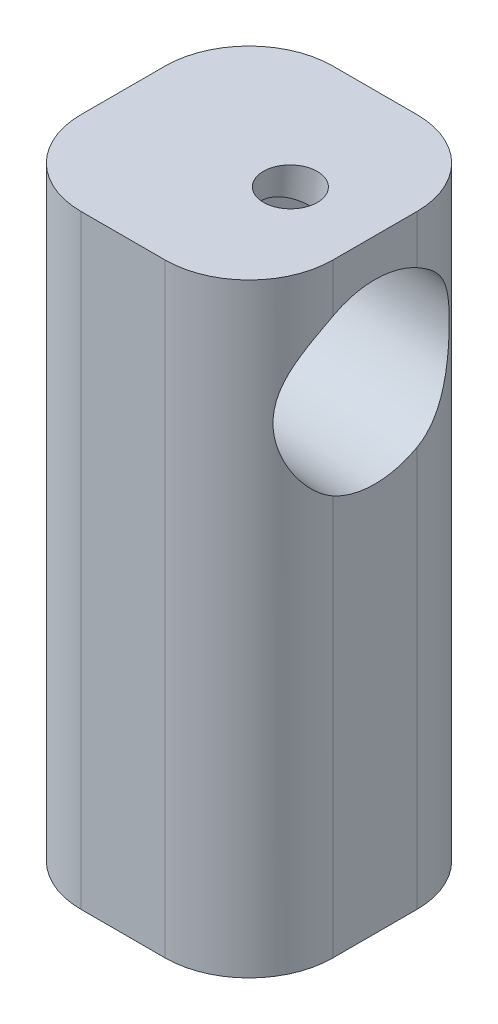
ISO-10303-21;
HEADER;
FILE_DESCRIPTION(('STEP AP214'),'2;1');
FILE_NAME('part.step','',(''),(''),'','','');
FILE_SCHEMA(('AUTOMOTIVE_DESIGN { 1 0 10303 214 1 1 1 1 }'));
ENDSEC;
DATA;
#1=APPLICATION_CONTEXT('core data for automotive mechanical design processes');
#2=APPLICATION_PROTOCOL_DEFINITION('international standard','automotive_design',2000,#1);
#3=PRODUCT_CONTEXT('',#1,'mechanical');
#4=PRODUCT('Part','Part','',(#3));
#5=PRODUCT_RELATED_PRODUCT_CATEGORY('part','',(#4));
#6=PRODUCT_DEFINITION_FORMATION('','',#4);
#7=PRODUCT_DEFINITION_CONTEXT('part definition',#1,'design');
#8=PRODUCT_DEFINITION('design','',#6,#7);
#9=PRODUCT_DEFINITION_SHAPE('','',#8);
#10=(LENGTH_UNIT() NAMED_UNIT(*) SI_UNIT(.MILLI.,.METRE.));
#11=(NAMED_UNIT(*) PLANE_ANGLE_UNIT() SI_UNIT($,.RADIAN.));
#12=(NAMED_UNIT(*) SI_UNIT($,.STERADIAN.) SOLID_ANGLE_UNIT());
#13=UNCERTAINTY_MEASURE_WITH_UNIT(LENGTH_MEASURE(1.E-05),#10,'distance_accuracy_value','');
#14=(GEOMETRIC_REPRESENTATION_CONTEXT(3) GLOBAL_UNCERTAINTY_ASSIGNED_CONTEXT((#13)) GLOBAL_UNIT_ASSIGNED_CONTEXT((#10,
#11,#12)) REPRESENTATION_CONTEXT('',''));
#15=CARTESIAN_POINT('',(0.,0.,0.));
#16=DIRECTION('',(0.,0.,1.));
#17=DIRECTION('',(1.,0.,0.));
#18=AXIS2_PLACEMENT_3D('',#15,#16,#17);
#19=CARTESIAN_POINT('',(10.2157187728761,28.2038178143041,0.));
#20=DIRECTION('',(-0.995396198367179,0.0958457525202242,0.));
#21=DIRECTION('',(-0.0958457525202242,-0.995396198367179,0.));
#22=AXIS2_PLACEMENT_3D('',#19,#20,#21);
#23=CYLINDRICAL_SURFACE('',#22,5.25);
#24=CARTESIAN_POINT('',(-0.18661653247194,29.2054487798877,0.));
#25=DIRECTION('',(0.995396198367179,-0.0958457525202242,0.));
#26=DIRECTION('',(0.0958457525202242,0.995396198367179,0.));
#27=AXIS2_PLACEMENT_3D('',#24,#25,#26);
#28=CIRCLE('',#27,5.25);
#29=CARTESIAN_POINT('',(0.316573668259237,34.4312788213154,0.));
#30=VERTEX_POINT('',#29);
#31=EDGE_CURVE('E163',#30,#30,#28,.T.);
#32=ORIENTED_EDGE('',*,*,#31,.F.);
#33=EDGE_LOOP('',(#32));
#34=FACE_BOUND('',#33,.T.);
#35=CARTESIAN_POINT('',(7.5,28.4653117901165,0.));
#36=DIRECTION('',(-1.,0.,0.));
#37=DIRECTION('',(0.,1.,0.));
#38=AXIS2_PLACEMENT_3D('',#35,#36,#37);
#39=ELLIPSE('',#38,5.27428174691842,5.25);
#40=CARTESIAN_POINT('',(7.5,33.1032100820004,-2.5));
#41=VERTEX_POINT('',#40);
#42=CARTESIAN_POINT('',(7.5,33.1032100820004,2.5));
#43=VERTEX_POINT('',#42);
#44=EDGE_CURVE('E59',#41,#43,#39,.F.);
#45=ORIENTED_EDGE('',*,*,#44,.T.);
#46=CARTESIAN_POINT('',(7.5,23.8274134982327,2.5));
#47=CARTESIAN_POINT('',(7.5000115752968,23.8927678623588,2.62018650620459));
#48=CARTESIAN_POINT('',(7.49566827138946,23.9631423750051,2.73751600941263));
#49=CARTESIAN_POINT('',(7.47958977796429,24.112872854166,2.96549680146251));
#50=CARTESIAN_POINT('',(7.4678671041971,24.192213427261,3.07615905076094));
#51=CARTESIAN_POINT('',(7.43846862667576,24.3583119322207,3.28931267671159));
#52=CARTESIAN_POINT('',(7.42084601580531,24.4449985937958,3.39186728379978));
#53=CARTESIAN_POINT('',(7.38090327302345,24.6255528901397,3.58947339538549));
#54=CARTESIAN_POINT('',(7.35858112569253,24.7194235947921,3.68452165662306));
#55=CARTESIAN_POINT('',(7.28674047875172,25.0094395011213,3.95676481057582));
#56=CARTESIAN_POINT('',(7.23210021472681,25.2152043723929,4.12259871434237));
#57=CARTESIAN_POINT('',(7.14687971141707,25.5396504698289,4.34742506234745));
#58=CARTESIAN_POINT('',(7.11786644757508,25.6506771327631,4.41850118574999));
#59=CARTESIAN_POINT('',(7.05989163151479,25.8775705571239,4.55248819234434));
#60=CARTESIAN_POINT('',(7.03093008636022,25.9934379337644,4.61539803347207));
#61=CARTESIAN_POINT('',(6.93642200544951,26.3870504669977,4.81113532003393));
#62=CARTESIAN_POINT('',(6.87346732276981,26.6750635949737,4.92562424622554));
#63=CARTESIAN_POINT('',(6.79499414489277,27.1203276496223,5.06040993345684));
#64=CARTESIAN_POINT('',(6.77150439258019,27.2708737447383,5.0991698563426));
#65=CARTESIAN_POINT('',(6.7314436436814,27.5756567335923,5.16389718587623));
#66=CARTESIAN_POINT('',(6.7148714632035,27.7298929910048,5.18986678163177));
#67=CARTESIAN_POINT('',(6.69070777181306,28.0322434271527,5.22735014284705));
#68=CARTESIAN_POINT('',(6.68267701848308,28.1802345966139,5.23957302600452));
#69=CARTESIAN_POINT('',(6.67475329582567,28.4769501681375,5.25163436051313));
#70=CARTESIAN_POINT('',(6.6748598736388,28.6256745289358,5.25147350104537));
#71=CARTESIAN_POINT('',(6.68333451800781,28.9222840375265,5.23857080777005));
#72=CARTESIAN_POINT('',(6.69169959080258,29.0701694698981,5.22583353299917));
#73=CARTESIAN_POINT('',(6.7161649176327,29.363660473326,5.18783568863149));
#74=CARTESIAN_POINT('',(6.73226478189367,29.5092661588824,5.16257575007919));
#75=CARTESIAN_POINT('',(6.76810231343031,29.7746400275823,5.10466221270636));
#76=CARTESIAN_POINT('',(6.78689307043667,29.8949232105523,5.0737548870642));
#77=CARTESIAN_POINT('',(6.82833625583039,30.1323098007199,5.00343170194063));
#78=CARTESIAN_POINT('',(6.85098991640635,30.2494121794446,4.96401312647004));
#79=CARTESIAN_POINT('',(6.92328834531948,30.5952764858473,4.83333279726245));
#80=CARTESIAN_POINT('',(6.97726478263407,30.8185569278981,4.7296549571062));
#81=CARTESIAN_POINT('',(7.09439487890042,31.2713857643292,4.47810070900819));
#82=CARTESIAN_POINT('',(7.15789583975968,31.4987840859266,4.32655030827397));
#83=CARTESIAN_POINT('',(7.27671319006236,31.9279147196296,3.98828797495868));
#84=CARTESIAN_POINT('',(7.33204286085387,32.1296886043685,3.80163424653369));
#85=CARTESIAN_POINT('',(7.39614240626913,32.3925570002548,3.51730394838744));
#86=CARTESIAN_POINT('',(7.41304904310161,32.4660351057519,3.43261548720782));
#87=CARTESIAN_POINT('',(7.44293748374284,32.6078731408655,3.25839887973002));
#88=CARTESIAN_POINT('',(7.45592036714128,32.6762344744196,3.16887207267059));
#89=CARTESIAN_POINT('',(7.47727622241994,32.8077472814441,2.98508007849629));
#90=CARTESIAN_POINT('',(7.48563366250557,32.870880603606,2.89080007285826));
#91=CARTESIAN_POINT('',(7.49700250933391,32.9914281935094,2.69824586021539));
#92=CARTESIAN_POINT('',(7.50000978302263,33.0488380074992,2.59996862520474));
#93=CARTESIAN_POINT('',(7.5,33.1032100820004,2.5));
#94=B_SPLINE_CURVE_WITH_KNOTS('',3,(#46,#47,#48,#49,#50,#51,#52,#53,#54,#55,#56,#57,#58,#59,#60,
#61,#62,#63,#64,#65,#66,#67,#68,#69,#70,#71,#72,#73,#74,#75,#76,#77,#78,#79,#80,#81,#82,#83,#84,
#85,#86,#87,#88,#89,#90,#91,#92,#93),.UNSPECIFIED.,.F.,.F.,(4,2,2,2,2,2,2,2,2,2,2,2,2,2,2,2,2,2,
2,2,2,2,2,4),(0.,0.410066313355361,0.819439002355257,1.2252160219284,1.63116741676319,
2.43720185029728,2.84188785644462,3.24662545217151,4.18986221732903,4.66098531622723,
5.13202775277063,5.57746273640006,6.02287293066184,6.46812171993643,6.91334807442819,
7.28975791264398,7.66628804340756,8.41946704241959,9.25787929507611,10.0949134566852,
10.4348603953986,10.7747137150718,11.1157014109618,11.4569524088677),.UNSPECIFIED.);
#95=CARTESIAN_POINT('',(7.5,23.8274134982327,2.5));
#96=VERTEX_POINT('',#95);
#97=EDGE_CURVE('E124',#96,#43,#94,.T.);
#98=ORIENTED_EDGE('',*,*,#97,.F.);
#99=CARTESIAN_POINT('',(7.5,28.4653117901165,0.));
#100=DIRECTION('',(-1.,0.,0.));
#101=DIRECTION('',(0.,1.,0.));
#102=AXIS2_PLACEMENT_3D('',#99,#100,#101);
#103=ELLIPSE('',#102,5.27428174691842,5.25);
#104=CARTESIAN_POINT('',(7.5,23.8274134982327,-2.5));
#105=VERTEX_POINT('',#104);
#106=EDGE_CURVE('E127',#96,#105,#103,.F.);
#107=ORIENTED_EDGE('',*,*,#106,.T.);
#108=CARTESIAN_POINT('',(7.5,33.1032100820004,-2.5));
#109=CARTESIAN_POINT('',(7.50001998674062,33.0369019499913,-2.62193681639777));
#110=CARTESIAN_POINT('',(7.49554108527629,32.9660735277141,-2.7413295682139));
#111=CARTESIAN_POINT('',(7.4788440174948,32.8160154440221,-2.97396196931254));
#112=CARTESIAN_POINT('',(7.46663478838785,32.7367955721086,-3.08720856037974));
#113=CARTESIAN_POINT('',(7.43582015690662,32.5709244239072,-3.30612782935598));
#114=CARTESIAN_POINT('',(7.41725255069452,32.4843192822286,-3.41184090153194));
#115=CARTESIAN_POINT('',(7.3750309193707,32.3038464226561,-3.61576469458365));
#116=CARTESIAN_POINT('',(7.35137548377914,32.2099766954574,-3.71397332477822));
#117=CARTESIAN_POINT('',(7.27496401687642,31.9189550510605,-3.99579784659961));
#118=CARTESIAN_POINT('',(7.21659127928187,31.7115936174592,-4.16766230108876));
#119=CARTESIAN_POINT('',(7.12600744810291,31.3830528181752,-4.39920939781707));
#120=CARTESIAN_POINT('',(7.09526121280936,31.2704440379201,-4.47210471169599));
#121=CARTESIAN_POINT('',(7.03413875176891,31.0396850878396,-4.60883345072613));
#122=CARTESIAN_POINT('',(7.00376256482431,30.9215343430924,-4.67266593292348));
#123=CARTESIAN_POINT('',(6.94208303892426,30.6690186338683,-4.79632556400705));
#124=CARTESIAN_POINT('',(6.91095269150025,30.5341633994023,-4.8552399415599));
#125=CARTESIAN_POINT('',(6.85267139092977,30.2591204645297,-4.96128296906913));
#126=CARTESIAN_POINT('',(6.82551858285744,30.1189352884075,-5.00841712002388));
#127=CARTESIAN_POINT('',(6.77693696656577,29.8343124495308,-5.09038259213347));
#128=CARTESIAN_POINT('',(6.75549779459445,29.6898830211501,-5.12523622597816));
#129=CARTESIAN_POINT('',(6.71972833053916,29.3976959304438,-5.18235665097596));
#130=CARTESIAN_POINT('',(6.70539672635829,29.2499388876835,-5.20462576540791));
#131=CARTESIAN_POINT('',(6.68582510135536,28.9670839900684,-5.23480440310699));
#132=CARTESIAN_POINT('',(6.67983182798382,28.8321643809841,-5.24390716345121));
#133=CARTESIAN_POINT('',(6.6747041398593,28.5619014314784,-5.25170279103364));
#134=CARTESIAN_POINT('',(6.67556936328051,28.4265581137868,-5.2503962074256));
#135=CARTESIAN_POINT('',(6.684009206645,28.1565132563051,-5.23754021107649));
#136=CARTESIAN_POINT('',(6.69158686873349,28.021812035352,-5.22598615407373));
#137=CARTESIAN_POINT('',(6.71288761917239,27.7541583479324,-5.19294442185493));
#138=CARTESIAN_POINT('',(6.72661089985077,27.621205936329,-5.17145643575457));
#139=CARTESIAN_POINT('',(6.77371793498652,27.2426453014374,-5.0959160745952));
#140=CARTESIAN_POINT('',(6.81380011009303,27.0001889226442,-5.02981883141516));
#141=CARTESIAN_POINT('',(6.9055590391362,26.5282102421331,-4.86638130914973));
#142=CARTESIAN_POINT('',(6.95725139687039,26.2987058718862,-4.76899890707187));
#143=CARTESIAN_POINT('',(7.04272489003272,25.9454801921234,-4.59024061850044));
#144=CARTESIAN_POINT('',(7.07527789706862,25.8165723480858,-4.51836399100458));
#145=CARTESIAN_POINT('',(7.14014529416681,25.5649320356772,-4.36441535069588));
#146=CARTESIAN_POINT('',(7.17245961114434,25.4422013968611,-4.28234034201994));
#147=CARTESIAN_POINT('',(7.26647746270493,25.0848068555535,-4.0214263431919));
#148=CARTESIAN_POINT('',(7.32550896478912,24.8599814306624,-3.82741551698741));
#149=CARTESIAN_POINT('',(7.39293306082581,24.5723044160512,-3.53262419097886));
#150=CARTESIAN_POINT('',(7.41016404383055,24.4947553149705,-3.44773666763902));
#151=CARTESIAN_POINT('',(7.44075545229649,24.3452111860705,-3.2725496714031));
#152=CARTESIAN_POINT('',(7.45411750783841,24.2732138285642,-3.18225249714544));
#153=CARTESIAN_POINT('',(7.47622022909484,24.1349391406551,-2.99604823729854));
#154=CARTESIAN_POINT('',(7.48493516514018,24.0686953224586,-2.90011311796905));
#155=CARTESIAN_POINT('',(7.49683207207068,23.9428754701684,-2.7034785419648));
#156=CARTESIAN_POINT('',(7.50000712729515,23.8833078568882,-2.60277329130369));
#157=CARTESIAN_POINT('',(7.5,23.8274134982327,-2.5));
#158=B_SPLINE_CURVE_WITH_KNOTS('',3,(#108,#109,#110,#111,#112,#113,#114,#115,#116,#117,#118,
#119,#120,#121,#122,#123,#124,#125,#126,#127,#128,#129,#130,#131,#132,#133,#134,#135,#136,#137,
#138,#139,#140,#141,#142,#143,#144,#145,#146,#147,#148,#149,#150,#151,#152,#153,#154,#155,#156,
#157),.UNSPECIFIED.,.F.,.F.,(4,2,2,2,2,2,2,2,2,2,2,2,2,2,2,2,2,2,2,2,2,2,2,2,4),(0.,
0.416119348822604,0.831758488724067,1.24496863654772,1.65829348506126,2.48100069035423,
2.89357086079916,3.3061839262248,3.75686213965554,4.20732950554665,4.65697413677774,
5.10653573016003,5.51204614722256,5.9175351713815,6.3232080613502,6.72889364779374,
7.48933084424157,8.25079623078237,8.70376219465684,9.15686153719988,10.0597846390729,
10.4083435205131,10.756755330535,11.1070766700245,11.4578350179764),.UNSPECIFIED.);
#159=EDGE_CURVE('E183',#41,#105,#158,.T.);
#160=ORIENTED_EDGE('',*,*,#159,.F.);
#161=EDGE_LOOP('',(#45,#98,#107,#160));
#162=FACE_BOUND('',#161,.T.);
#163=CARTESIAN_POINT('',(0.699776919924022,34.3943805449464,0.));
#164=CARTESIAN_POINT('',(0.699777738487861,34.3943798222301,-0.0877095829599574));
#165=CARTESIAN_POINT('',(0.706766951507206,34.3914783148794,-0.175428139234278));
#166=CARTESIAN_POINT('',(0.734485554989229,34.3801372466754,-0.348306725127632));
#167=CARTESIAN_POINT('',(0.755218669631588,34.3716961847772,-0.433466054734184));
#168=CARTESIAN_POINT('',(0.809710438519464,34.3500501798546,-0.598707911694997));
#169=CARTESIAN_POINT('',(0.843449518096817,34.3368523978786,-0.678797858853131));
#170=CARTESIAN_POINT('',(0.922983453965627,34.3068178386677,-0.831997653720761));
#171=CARTESIAN_POINT('',(0.968780027318224,34.289980543205,-0.905106505257146));
#172=CARTESIAN_POINT('',(1.07264381016868,34.2535589992063,-1.04442803485955));
#173=CARTESIAN_POINT('',(1.13100505212719,34.2339135880824,-1.11040550483363));
#174=CARTESIAN_POINT('',(1.25783971278431,34.1938582584343,-1.23153882879992));
#175=CARTESIAN_POINT('',(1.32631489623257,34.1734482069554,-1.28669279031359));
#176=CARTESIAN_POINT('',(1.47351043498286,34.1330657549761,-1.38586534654311));
#177=CARTESIAN_POINT('',(1.55243244654785,34.1131146554458,-1.4295943148774));
#178=CARTESIAN_POINT('',(1.71720899916109,34.0758597408964,-1.50280224576308));
#179=CARTESIAN_POINT('',(1.80306180882419,34.0585552678299,-1.53228475445071));
#180=CARTESIAN_POINT('',(1.97673481072115,34.0284378045448,-1.57531000140866));
#181=CARTESIAN_POINT('',(2.06442711584237,34.0155098041795,-1.58928738558295));
#182=CARTESIAN_POINT('',(2.24145748840112,33.9943054756329,-1.60226310554936));
#183=CARTESIAN_POINT('',(2.33079513700529,33.9860279800851,-1.60126520217188));
#184=CARTESIAN_POINT('',(2.50502593001073,33.9745617224082,-1.58465952487205));
#185=CARTESIAN_POINT('',(2.58996037980374,33.9711943055541,-1.5695992744651));
#186=CARTESIAN_POINT('',(2.75641913579608,33.9686235117149,-1.52618219944499));
#187=CARTESIAN_POINT('',(2.83794309480675,33.9694205576381,-1.49782402467079));
#188=CARTESIAN_POINT('',(2.99653022205708,33.9744428775065,-1.428219088008));
#189=CARTESIAN_POINT('',(3.07351464935774,33.9787161474971,-1.38679688637858));
#190=CARTESIAN_POINT('',(3.21982755765982,33.9896627702984,-1.29236161942605));
#191=CARTESIAN_POINT('',(3.2891541260673,33.9963367209292,-1.23934566830525));
#192=CARTESIAN_POINT('',(3.42123075317983,34.0111821698027,-1.12052082833061));
#193=CARTESIAN_POINT('',(3.48356767963335,34.0194058810312,-1.05425845581457));
#194=CARTESIAN_POINT('',(3.59629400381892,34.0357553123357,-0.912224424592942));
#195=CARTESIAN_POINT('',(3.64668260076278,34.0438810258093,-0.836452129043607));
#196=CARTESIAN_POINT('',(3.73425197461701,34.0588186544157,-0.676775481442183));
#197=CARTESIAN_POINT('',(3.77133642508143,34.065620830851,-0.592817205979653));
#198=CARTESIAN_POINT('',(3.83044263990114,34.0767841347102,-0.419605475352042));
#199=CARTESIAN_POINT('',(3.85246874542182,34.0811459655947,-0.330353554360794));
#200=CARTESIAN_POINT('',(3.88006807403434,34.0866534735221,-0.152624537102264));
#201=CARTESIAN_POINT('',(3.88621864117471,34.0879119311854,-0.0642404637994652));
#202=CARTESIAN_POINT('',(3.8835013967688,34.0873615191741,0.112279032093748));
#203=CARTESIAN_POINT('',(3.87463566078544,34.0855530734089,0.200414487361721));
#204=CARTESIAN_POINT('',(3.84262197881723,34.0792074716815,0.371789057943173));
#205=CARTESIAN_POINT('',(3.8198135809279,34.0747352515402,0.455094513780931));
#206=CARTESIAN_POINT('',(3.76101732925929,34.0637308084984,0.616765676375094));
#207=CARTESIAN_POINT('',(3.72502787369243,34.0571983352454,0.69513078141333));
#208=CARTESIAN_POINT('',(3.64000699764058,34.0427991118464,0.846753612472818));
#209=CARTESIAN_POINT('',(3.59068765153273,34.0349044948183,0.919847018400831));
#210=CARTESIAN_POINT('',(3.48085280688173,34.0190526981915,1.05707622394061));
#211=CARTESIAN_POINT('',(3.42033441446204,34.0110955029324,1.12120970073781));
#212=CARTESIAN_POINT('',(3.2872299126005,33.9961061167814,1.24119656582309));
#213=CARTESIAN_POINT('',(3.2142759166767,33.9891198946086,1.2966484782013));
#214=CARTESIAN_POINT('',(3.06000108678877,33.9778491389036,1.39472275439474));
#215=CARTESIAN_POINT('',(2.97868044212874,33.9735645442601,1.43734540839961));
#216=CARTESIAN_POINT('',(2.81031535012749,33.9689520563009,1.50826881292794));
#217=CARTESIAN_POINT('',(2.72329794206605,33.9686066660348,1.53663236106683));
#218=CARTESIAN_POINT('',(2.54584248022742,33.9726963508528,1.57828583341556));
#219=CARTESIAN_POINT('',(2.4554056586878,33.9771297193868,1.59158113519386));
#220=CARTESIAN_POINT('',(2.27788968178148,33.9907681029935,1.60234725811094));
#221=CARTESIAN_POINT('',(2.19083340571643,33.999759691868,1.60047408593909));
#222=CARTESIAN_POINT('',(2.01876926695903,34.0220621308031,1.58252900575096));
#223=CARTESIAN_POINT('',(1.93376131742526,34.0353727974037,1.56645770077447));
#224=CARTESIAN_POINT('',(1.7692570532391,34.0652584860708,1.52100203229453));
#225=CARTESIAN_POINT('',(1.68970269236094,34.0817879837213,1.49179664087031));
#226=CARTESIAN_POINT('',(1.53681406249054,34.1170329740376,1.42104171061348));
#227=CARTESIAN_POINT('',(1.46348101656303,34.1357488948268,1.37948975173249));
#228=CARTESIAN_POINT('',(1.32205817151328,34.1746923020743,1.2833997696231));
#229=CARTESIAN_POINT('',(1.25426759306008,34.1949501476566,1.22843368462233));
#230=CARTESIAN_POINT('',(1.1286548139446,34.2346938451233,1.10783970308769));
#231=CARTESIAN_POINT('',(1.07083523727172,34.2541794927585,1.04220900883209));
#232=CARTESIAN_POINT('',(0.964941197715081,34.2913412165147,0.899738398219265));
#233=CARTESIAN_POINT('',(0.917217813124676,34.3089439593475,0.822617617894377));
#234=CARTESIAN_POINT('',(0.835170195268976,34.3400399151351,0.660806006214705));
#235=CARTESIAN_POINT('',(0.800840067045315,34.3535349355023,0.576118525514105));
#236=CARTESIAN_POINT('',(0.749332733416378,34.3740835974493,0.41020845240547));
#237=CARTESIAN_POINT('',(0.730797708498414,34.3816412692239,0.329467929591525));
#238=CARTESIAN_POINT('',(0.706020520198721,34.3917896379541,0.165820682652466));
#239=CARTESIAN_POINT('',(0.699776146112462,34.3943812281506,0.0829143508076444));
#240=CARTESIAN_POINT('',(0.699776919924022,34.3943805449464,0.));
#241=B_SPLINE_CURVE_WITH_KNOTS('',3,(#163,#164,#165,#166,#167,#168,#169,#170,#171,#172,#173,
#174,#175,#176,#177,#178,#179,#180,#181,#182,#183,#184,#185,#186,#187,#188,#189,#190,#191,#192,
#193,#194,#195,#196,#197,#198,#199,#200,#201,#202,#203,#204,#205,#206,#207,#208,#209,#210,#211,
#212,#213,#214,#215,#216,#217,#218,#219,#220,#221,#222,#223,#224,#225,#226,#227,#228,#229,#230,
#231,#232,#233,#234,#235,#236,#237,#238,#239,#240),.UNSPECIFIED.,.T.,.F.,(4,2,2,2,2,2,2,2,2,2,2,
2,2,2,2,2,2,2,2,2,2,2,2,2,2,2,2,2,2,2,2,2,2,2,2,2,2,2,4),(0.,0.262824109285108,
0.525719465044115,0.788220684481565,1.05075930594256,1.32028245219729,1.58985268237135,
1.86570841849144,2.14149545497736,2.40933915695281,2.67711559491932,2.93488232680653,
3.19267523585977,3.4540891346815,3.71556817619335,3.98833576632651,4.26112163243436,
4.53584449046141,4.81048811528961,5.07499324760703,5.33946182284088,5.59773301878419,
5.85603561076138,6.12043824156485,6.38490929067034,6.65931385728077,6.93371221656851,
7.20689129051521,7.47997284135405,7.74130933651229,8.00263473241335,8.26050227388833,
8.51842039331228,8.78599781767931,9.05364555117195,9.32945786465114,9.60514864372853,
9.85364841316143,10.1021034811546),.UNSPECIFIED.);
#242=CARTESIAN_POINT('',(0.699776919924022,34.3943805449464,0.));
#243=VERTEX_POINT('',#242);
#244=EDGE_CURVE('E502',#243,#243,#241,.T.);
#245=ORIENTED_EDGE('',*,*,#244,.F.);
#246=EDGE_LOOP('',(#245));
#247=FACE_BOUND('',#246,.T.);
#248=ADVANCED_FACE('F43',(#34,#162,#247),#23,.F.);
#249=CARTESIAN_POINT('',(2.5,20.,-2.5));
#250=DIRECTION('',(0.,-1.,0.));
#251=DIRECTION('',(0.,0.,-1.));
#252=AXIS2_PLACEMENT_3D('',#249,#250,#251);
#253=CYLINDRICAL_SURFACE('',#252,5.);
#254=DIRECTION('',(0.,-1.,0.));
#255=VECTOR('',#254,1.);
#256=CARTESIAN_POINT('',(7.5,20.,-2.5));
#257=LINE('',#256,#255);
#258=CARTESIAN_POINT('',(7.5,36.,-2.5));
#259=VERTEX_POINT('',#258);
#260=EDGE_CURVE('E152',#41,#259,#257,.F.);
#261=ORIENTED_EDGE('',*,*,#260,.F.);
#262=ORIENTED_EDGE('',*,*,#159,.T.);
#263=CARTESIAN_POINT('',(7.5,0.,-2.5));
#264=VERTEX_POINT('',#263);
#265=EDGE_CURVE('E142',#264,#105,#257,.F.);
#266=ORIENTED_EDGE('',*,*,#265,.F.);
#267=CARTESIAN_POINT('',(2.5,0.,-2.5));
#268=DIRECTION('',(0.,1.,0.));
#269=DIRECTION('',(0.,0.,1.));
#270=AXIS2_PLACEMENT_3D('',#267,#268,#269);
#271=CIRCLE('',#270,5.);
#272=CARTESIAN_POINT('',(2.5,0.,-7.5));
#273=VERTEX_POINT('',#272);
#274=EDGE_CURVE('E232',#273,#264,#271,.F.);
#275=ORIENTED_EDGE('',*,*,#274,.F.);
#276=DIRECTION('',(0.,-1.,0.));
#277=VECTOR('',#276,1.);
#278=CARTESIAN_POINT('',(2.5,20.,-7.5));
#279=LINE('',#278,#277);
#280=CARTESIAN_POINT('',(2.5,36.,-7.5));
#281=VERTEX_POINT('',#280);
#282=EDGE_CURVE('E227',#281,#273,#279,.T.);
#283=ORIENTED_EDGE('',*,*,#282,.F.);
#284=CARTESIAN_POINT('',(2.5,36.,-2.5));
#285=DIRECTION('',(0.,-1.,0.));
#286=DIRECTION('',(0.,0.,-1.));
#287=AXIS2_PLACEMENT_3D('',#284,#285,#286);
#288=CIRCLE('',#287,5.);
#289=EDGE_CURVE('E153',#259,#281,#288,.F.);
#290=ORIENTED_EDGE('',*,*,#289,.F.);
#291=EDGE_LOOP('',(#261,#262,#266,#275,#283,#290));
#292=FACE_BOUND('',#291,.T.);
#293=ADVANCED_FACE('F175',(#292),#253,.T.);
#294=CARTESIAN_POINT('',(2.5,20.,2.5));
#295=DIRECTION('',(0.,-1.,0.));
#296=DIRECTION('',(0.,0.,-1.));
#297=AXIS2_PLACEMENT_3D('',#294,#295,#296);
#298=CYLINDRICAL_SURFACE('',#297,5.);
#299=DIRECTION('',(0.,-1.,0.));
#300=VECTOR('',#299,1.);
#301=CARTESIAN_POINT('',(7.5,20.,2.5));
#302=LINE('',#301,#300);
#303=CARTESIAN_POINT('',(7.5,0.,2.5));
#304=VERTEX_POINT('',#303);
#305=EDGE_CURVE('E139',#96,#304,#302,.T.);
#306=ORIENTED_EDGE('',*,*,#305,.F.);
#307=ORIENTED_EDGE('',*,*,#97,.T.);
#308=CARTESIAN_POINT('',(7.5,36.,2.5));
#309=VERTEX_POINT('',#308);
#310=EDGE_CURVE('E149',#309,#43,#302,.T.);
#311=ORIENTED_EDGE('',*,*,#310,.F.);
#312=CARTESIAN_POINT('',(2.5,36.,2.5));
#313=DIRECTION('',(0.,-1.,0.));
#314=DIRECTION('',(0.,0.,-1.));
#315=AXIS2_PLACEMENT_3D('',#312,#313,#314);
#316=CIRCLE('',#315,5.);
#317=CARTESIAN_POINT('',(2.5,36.,7.5));
#318=VERTEX_POINT('',#317);
#319=EDGE_CURVE('E221',#318,#309,#316,.F.);
#320=ORIENTED_EDGE('',*,*,#319,.F.);
#321=DIRECTION('',(0.,-1.,0.));
#322=VECTOR('',#321,1.);
#323=CARTESIAN_POINT('',(2.5,20.,7.5));
#324=LINE('',#323,#322);
#325=CARTESIAN_POINT('',(2.5,0.,7.5));
#326=VERTEX_POINT('',#325);
#327=EDGE_CURVE('E158',#326,#318,#324,.F.);
#328=ORIENTED_EDGE('',*,*,#327,.F.);
#329=CARTESIAN_POINT('',(2.5,0.,2.5));
#330=DIRECTION('',(0.,1.,0.));
#331=DIRECTION('',(0.,0.,1.));
#332=AXIS2_PLACEMENT_3D('',#329,#330,#331);
#333=CIRCLE('',#332,5.);
#334=EDGE_CURVE('E147',#304,#326,#333,.F.);
#335=ORIENTED_EDGE('',*,*,#334,.F.);
#336=EDGE_LOOP('',(#306,#307,#311,#320,#328,#335));
#337=FACE_BOUND('',#336,.T.);
#338=ADVANCED_FACE('F145',(#337),#298,.T.);
#339=CARTESIAN_POINT('',(-8.08104701975917,29.9655959775702,0.));
#340=DIRECTION('',(0.995396198367179,-0.0958457525202242,0.));
#341=DIRECTION('',(0.0958457525202242,0.995396198367179,0.));
#342=AXIS2_PLACEMENT_3D('',#339,#340,#341);
#343=CYLINDRICAL_SURFACE('',#342,2.5);
#344=CARTESIAN_POINT('',(-7.5,29.9096475130796,0.));
#345=DIRECTION('',(1.,0.,0.));
#346=DIRECTION('',(0.,-1.,0.));
#347=AXIS2_PLACEMENT_3D('',#344,#345,#346);
#348=ELLIPSE('',#347,2.51156273662782,2.5);
#349=CARTESIAN_POINT('',(-7.5,29.9096475130796,2.5));
#350=VERTEX_POINT('',#349);
#351=CARTESIAN_POINT('',(-7.5,29.9096475130796,-2.5));
#352=VERTEX_POINT('',#351);
#353=EDGE_CURVE('E191',#350,#352,#348,.T.);
#354=ORIENTED_EDGE('',*,*,#353,.F.);
#355=EDGE_CURVE('E66',#352,#350,#348,.T.);
#356=ORIENTED_EDGE('',*,*,#355,.F.);
#357=EDGE_LOOP('',(#354,#356));
#358=FACE_BOUND('',#357,.T.);
#359=CARTESIAN_POINT('',(-0.18661653247194,29.2054487798877,0.));
#360=DIRECTION('',(0.995396198367179,-0.0958457525202242,0.));
#361=DIRECTION('',(0.0958457525202242,0.995396198367179,0.));
#362=AXIS2_PLACEMENT_3D('',#359,#360,#361);
#363=CIRCLE('',#362,2.5);
#364=CARTESIAN_POINT('',(0.0529978488286202,31.6939392758057,0.));
#365=VERTEX_POINT('',#364);
#366=EDGE_CURVE('E143',#365,#365,#363,.F.);
#367=ORIENTED_EDGE('',*,*,#366,.F.);
#368=EDGE_LOOP('',(#367));
#369=FACE_BOUND('',#368,.T.);
#370=ADVANCED_FACE('F179',(#358,#369),#343,.F.);
#371=CARTESIAN_POINT('',(-7.5,20.,7.5));
#372=DIRECTION('',(1.,0.,0.));
#373=DIRECTION('',(0.,0.,-1.));
#374=AXIS2_PLACEMENT_3D('',#371,#372,#373);
#375=PLANE('',#374);
#376=DIRECTION('',(0.,-1.,0.));
#377=VECTOR('',#376,1.);
#378=CARTESIAN_POINT('',(-7.5,20.,-2.5));
#379=LINE('',#378,#377);
#380=CARTESIAN_POINT('',(-7.5,36.,-2.5));
#381=VERTEX_POINT('',#380);
#382=EDGE_CURVE('E237',#381,#352,#379,.T.);
#383=ORIENTED_EDGE('',*,*,#382,.T.);
#384=ORIENTED_EDGE('',*,*,#355,.T.);
#385=DIRECTION('',(0.,-1.,0.));
#386=VECTOR('',#385,1.);
#387=CARTESIAN_POINT('',(-7.5,20.,2.5));
#388=LINE('',#387,#386);
#389=CARTESIAN_POINT('',(-7.5,36.,2.5));
#390=VERTEX_POINT('',#389);
#391=EDGE_CURVE('E215',#350,#390,#388,.F.);
#392=ORIENTED_EDGE('',*,*,#391,.T.);
#393=DIRECTION('',(0.,0.,1.));
#394=VECTOR('',#393,1.);
#395=CARTESIAN_POINT('',(-7.5,36.,7.5));
#396=LINE('',#395,#394);
#397=EDGE_CURVE('E259',#381,#390,#396,.T.);
#398=ORIENTED_EDGE('',*,*,#397,.F.);
#399=EDGE_LOOP('',(#383,#384,#392,#398));
#400=FACE_BOUND('',#399,.T.);
#401=ADVANCED_FACE('F278',(#400),#375,.F.);
#402=CARTESIAN_POINT('',(7.5,20.,7.5));
#403=DIRECTION('',(-1.,0.,0.));
#404=DIRECTION('',(0.,0.,1.));
#405=AXIS2_PLACEMENT_3D('',#402,#403,#404);
#406=PLANE('',#405);
#407=ORIENTED_EDGE('',*,*,#44,.F.);
#408=ORIENTED_EDGE('',*,*,#260,.T.);
#409=DIRECTION('',(0.,0.,-1.));
#410=VECTOR('',#409,1.);
#411=CARTESIAN_POINT('',(7.5,36.,7.5));
#412=LINE('',#411,#410);
#413=EDGE_CURVE('E263',#309,#259,#412,.T.);
#414=ORIENTED_EDGE('',*,*,#413,.F.);
#415=ORIENTED_EDGE('',*,*,#310,.T.);
#416=EDGE_LOOP('',(#407,#408,#414,#415));
#417=FACE_BOUND('',#416,.T.);
#418=ADVANCED_FACE('F292',(#417),#406,.F.);
#419=CARTESIAN_POINT('',(0.,0.,0.));
#420=DIRECTION('',(0.,1.,0.));
#421=DIRECTION('',(0.,0.,1.));
#422=AXIS2_PLACEMENT_3D('',#419,#420,#421);
#423=PLANE('',#422);
#424=DIRECTION('',(0.,0.,1.));
#425=VECTOR('',#424,1.);
#426=CARTESIAN_POINT('',(-7.5,0.,7.5));
#427=LINE('',#426,#425);
#428=CARTESIAN_POINT('',(-7.5,0.,-2.5));
#429=VERTEX_POINT('',#428);
#430=CARTESIAN_POINT('',(-7.5,0.,2.5));
#431=VERTEX_POINT('',#430);
#432=EDGE_CURVE('E251',#429,#431,#427,.T.);
#433=ORIENTED_EDGE('',*,*,#432,.F.);
#434=CARTESIAN_POINT('',(-2.5,0.,-2.5));
#435=DIRECTION('',(0.,1.,0.));
#436=DIRECTION('',(0.,0.,1.));
#437=AXIS2_PLACEMENT_3D('',#434,#435,#436);
#438=CIRCLE('',#437,5.);
#439=CARTESIAN_POINT('',(-2.5,0.,-7.5));
#440=VERTEX_POINT('',#439);
#441=EDGE_CURVE('E230',#429,#440,#438,.F.);
#442=ORIENTED_EDGE('',*,*,#441,.T.);
#443=DIRECTION('',(-1.,0.,0.));
#444=VECTOR('',#443,1.);
#445=CARTESIAN_POINT('',(7.5,0.,-7.5));
#446=LINE('',#445,#444);
#447=EDGE_CURVE('E243',#273,#440,#446,.T.);
#448=ORIENTED_EDGE('',*,*,#447,.F.);
#449=ORIENTED_EDGE('',*,*,#274,.T.);
#450=DIRECTION('',(0.,0.,-1.));
#451=VECTOR('',#450,1.);
#452=CARTESIAN_POINT('',(7.5,0.,7.5));
#453=LINE('',#452,#451);
#454=EDGE_CURVE('E246',#304,#264,#453,.T.);
#455=ORIENTED_EDGE('',*,*,#454,.F.);
#456=ORIENTED_EDGE('',*,*,#334,.T.);
#457=DIRECTION('',(1.,0.,0.));
#458=VECTOR('',#457,1.);
#459=CARTESIAN_POINT('',(7.5,0.,7.5));
#460=LINE('',#459,#458);
#461=CARTESIAN_POINT('',(-2.5,0.,7.5));
#462=VERTEX_POINT('',#461);
#463=EDGE_CURVE('E248',#462,#326,#460,.T.);
#464=ORIENTED_EDGE('',*,*,#463,.F.);
#465=CARTESIAN_POINT('',(-2.5,0.,2.5));
#466=DIRECTION('',(0.,1.,0.));
#467=DIRECTION('',(0.,0.,1.));
#468=AXIS2_PLACEMENT_3D('',#465,#466,#467);
#469=CIRCLE('',#468,5.);
#470=EDGE_CURVE('E234',#462,#431,#469,.F.);
#471=ORIENTED_EDGE('',*,*,#470,.T.);
#472=EDGE_LOOP('',(#433,#442,#448,#449,#455,#456,#464,#471));
#473=FACE_BOUND('',#472,.T.);
#474=CARTESIAN_POINT('',(0.,0.,0.));
#475=DIRECTION('',(0.,1.,0.));
#476=DIRECTION('',(0.,0.,1.));
#477=AXIS2_PLACEMENT_3D('',#474,#475,#476);
#478=CIRCLE('',#477,4.15);
#479=CARTESIAN_POINT('',(0.,0.,4.15));
#480=VERTEX_POINT('',#479);
#481=EDGE_CURVE('E254',#480,#480,#478,.T.);
#482=ORIENTED_EDGE('',*,*,#481,.T.);
#483=EDGE_LOOP('',(#482));
#484=FACE_BOUND('',#483,.T.);
#485=ADVANCED_FACE('F285',(#473,#484),#423,.F.);
#486=EDGE_CURVE('E241',#431,#350,#388,.F.);
#487=ORIENTED_EDGE('',*,*,#486,.T.);
#488=ORIENTED_EDGE('',*,*,#353,.T.);
#489=EDGE_CURVE('E240',#352,#429,#379,.T.);
#490=ORIENTED_EDGE('',*,*,#489,.T.);
#491=ORIENTED_EDGE('',*,*,#432,.T.);
#492=EDGE_LOOP('',(#487,#488,#490,#491));
#493=FACE_BOUND('',#492,.T.);
#494=ADVANCED_FACE('F271',(#493),#375,.F.);
#495=CARTESIAN_POINT('',(7.5,20.,7.5));
#496=DIRECTION('',(0.,0.,-1.));
#497=DIRECTION('',(-1.,0.,0.));
#498=AXIS2_PLACEMENT_3D('',#495,#496,#497);
#499=PLANE('',#498);
#500=DIRECTION('',(1.,0.,0.));
#501=VECTOR('',#500,1.);
#502=CARTESIAN_POINT('',(-7.5,36.,7.5));
#503=LINE('',#502,#501);
#504=CARTESIAN_POINT('',(-2.5,36.,7.5));
#505=VERTEX_POINT('',#504);
#506=EDGE_CURVE('E257',#505,#318,#503,.T.);
#507=ORIENTED_EDGE('',*,*,#506,.F.);
#508=DIRECTION('',(0.,-1.,0.));
#509=VECTOR('',#508,1.);
#510=CARTESIAN_POINT('',(-2.5,20.,7.5));
#511=LINE('',#510,#509);
#512=EDGE_CURVE('E133',#505,#462,#511,.T.);
#513=ORIENTED_EDGE('',*,*,#512,.T.);
#514=ORIENTED_EDGE('',*,*,#463,.T.);
#515=ORIENTED_EDGE('',*,*,#327,.T.);
#516=EDGE_LOOP('',(#507,#513,#514,#515));
#517=FACE_BOUND('',#516,.T.);
#518=ADVANCED_FACE('F289',(#517),#499,.F.);
#519=ORIENTED_EDGE('',*,*,#106,.F.);
#520=ORIENTED_EDGE('',*,*,#305,.T.);
#521=ORIENTED_EDGE('',*,*,#454,.T.);
#522=ORIENTED_EDGE('',*,*,#265,.T.);
#523=EDGE_LOOP('',(#519,#520,#521,#522));
#524=FACE_BOUND('',#523,.T.);
#525=ADVANCED_FACE('F137',(#524),#406,.F.);
#526=CARTESIAN_POINT('',(7.5,20.,-7.5));
#527=DIRECTION('',(0.,0.,1.));
#528=DIRECTION('',(1.,0.,0.));
#529=AXIS2_PLACEMENT_3D('',#526,#527,#528);
#530=PLANE('',#529);
#531=ORIENTED_EDGE('',*,*,#447,.T.);
#532=DIRECTION('',(0.,-1.,0.));
#533=VECTOR('',#532,1.);
#534=CARTESIAN_POINT('',(-2.5,20.,-7.5));
#535=LINE('',#534,#533);
#536=CARTESIAN_POINT('',(-2.5,36.,-7.5));
#537=VERTEX_POINT('',#536);
#538=EDGE_CURVE('E223',#440,#537,#535,.F.);
#539=ORIENTED_EDGE('',*,*,#538,.T.);
#540=DIRECTION('',(-1.,0.,0.));
#541=VECTOR('',#540,1.);
#542=CARTESIAN_POINT('',(-7.5,36.,-7.5));
#543=LINE('',#542,#541);
#544=EDGE_CURVE('E261',#281,#537,#543,.T.);
#545=ORIENTED_EDGE('',*,*,#544,.F.);
#546=ORIENTED_EDGE('',*,*,#282,.T.);
#547=EDGE_LOOP('',(#531,#539,#545,#546));
#548=FACE_BOUND('',#547,.T.);
#549=ADVANCED_FACE('F281',(#548),#530,.F.);
#550=CARTESIAN_POINT('',(0.,20.,0.));
#551=DIRECTION('',(0.,-1.,0.));
#552=DIRECTION('',(0.,0.,-1.));
#553=AXIS2_PLACEMENT_3D('',#550,#551,#552);
#554=CYLINDRICAL_SURFACE('',#553,4.15);
#555=CARTESIAN_POINT('',(0.,9.99999999999781,0.));
#556=DIRECTION('',(0.,-1.,0.));
#557=DIRECTION('',(0.,0.,-1.));
#558=AXIS2_PLACEMENT_3D('',#555,#556,#557);
#559=CIRCLE('',#558,4.15);
#560=CARTESIAN_POINT('',(0.,9.99999999999781,-4.15));
#561=VERTEX_POINT('',#560);
#562=EDGE_CURVE('E52',#561,#561,#559,.F.);
#563=ORIENTED_EDGE('',*,*,#562,.T.);
#564=EDGE_LOOP('',(#563));
#565=FACE_BOUND('',#564,.T.);
#566=ORIENTED_EDGE('',*,*,#481,.F.);
#567=EDGE_LOOP('',(#566));
#568=FACE_BOUND('',#567,.T.);
#569=ADVANCED_FACE('F308',(#565,#568),#554,.F.);
#570=CARTESIAN_POINT('',(0.,20.,0.));
#571=DIRECTION('',(0.,-1.,0.));
#572=DIRECTION('',(0.,0.,-1.));
#573=AXIS2_PLACEMENT_3D('',#570,#571,#572);
#574=PLANE('',#573);
#575=CARTESIAN_POINT('',(0.,20.,0.));
#576=DIRECTION('',(0.,-1.,0.));
#577=DIRECTION('',(0.,0.,-1.));
#578=AXIS2_PLACEMENT_3D('',#575,#576,#577);
#579=CIRCLE('',#578,3.97544935071775);
#580=CARTESIAN_POINT('',(0.,20.,-3.97544935071775));
#581=VERTEX_POINT('',#580);
#582=EDGE_CURVE('E11',#581,#581,#579,.T.);
#583=ORIENTED_EDGE('',*,*,#582,.T.);
#584=EDGE_LOOP('',(#583));
#585=FACE_BOUND('',#584,.T.);
#586=ADVANCED_FACE('F378',(#585),#574,.T.);
#587=CARTESIAN_POINT('',(0.,36.,0.));
#588=DIRECTION('',(0.,-1.,0.));
#589=DIRECTION('',(0.,0.,-1.));
#590=AXIS2_PLACEMENT_3D('',#587,#588,#589);
#591=PLANE('',#590);
#592=CARTESIAN_POINT('',(2.4617806404604,36.,0.));
#593=DIRECTION('',(0.,-1.,0.));
#594=DIRECTION('',(1.,0.,0.));
#595=AXIS2_PLACEMENT_3D('',#592,#593,#594);
#596=ELLIPSE('',#595,1.60740015144181,1.6);
#597=CARTESIAN_POINT('',(4.0691807919022,36.,0.));
#598=VERTEX_POINT('',#597);
#599=EDGE_CURVE('E507',#598,#598,#596,.T.);
#600=ORIENTED_EDGE('',*,*,#599,.T.);
#601=EDGE_LOOP('',(#600));
#602=FACE_BOUND('',#601,.T.);
#603=ORIENTED_EDGE('',*,*,#544,.T.);
#604=CARTESIAN_POINT('',(-2.5,36.,-2.5));
#605=DIRECTION('',(0.,-1.,0.));
#606=DIRECTION('',(0.,0.,-1.));
#607=AXIS2_PLACEMENT_3D('',#604,#605,#606);
#608=CIRCLE('',#607,5.);
#609=EDGE_CURVE('E150',#537,#381,#608,.F.);
#610=ORIENTED_EDGE('',*,*,#609,.T.);
#611=ORIENTED_EDGE('',*,*,#397,.T.);
#612=CARTESIAN_POINT('',(-2.5,36.,2.5));
#613=DIRECTION('',(0.,-1.,0.));
#614=DIRECTION('',(0.,0.,-1.));
#615=AXIS2_PLACEMENT_3D('',#612,#613,#614);
#616=CIRCLE('',#615,5.);
#617=EDGE_CURVE('E213',#390,#505,#616,.F.);
#618=ORIENTED_EDGE('',*,*,#617,.T.);
#619=ORIENTED_EDGE('',*,*,#506,.T.);
#620=ORIENTED_EDGE('',*,*,#319,.T.);
#621=ORIENTED_EDGE('',*,*,#413,.T.);
#622=ORIENTED_EDGE('',*,*,#289,.T.);
#623=EDGE_LOOP('',(#603,#610,#611,#618,#619,#620,#621,#622));
#624=FACE_BOUND('',#623,.T.);
#625=ADVANCED_FACE('F208',(#602,#624),#591,.F.);
#626=CARTESIAN_POINT('',(-2.5,20.,-2.5));
#627=DIRECTION('',(0.,-1.,0.));
#628=DIRECTION('',(0.,0.,-1.));
#629=AXIS2_PLACEMENT_3D('',#626,#627,#628);
#630=CYLINDRICAL_SURFACE('',#629,5.);
#631=ORIENTED_EDGE('',*,*,#609,.F.);
#632=ORIENTED_EDGE('',*,*,#538,.F.);
#633=ORIENTED_EDGE('',*,*,#441,.F.);
#634=ORIENTED_EDGE('',*,*,#489,.F.);
#635=ORIENTED_EDGE('',*,*,#382,.F.);
#636=EDGE_LOOP('',(#631,#632,#633,#634,#635));
#637=FACE_BOUND('',#636,.T.);
#638=ADVANCED_FACE('F197',(#637),#630,.T.);
#639=CARTESIAN_POINT('',(-2.5,20.,2.5));
#640=DIRECTION('',(0.,-1.,0.));
#641=DIRECTION('',(0.,0.,-1.));
#642=AXIS2_PLACEMENT_3D('',#639,#640,#641);
#643=CYLINDRICAL_SURFACE('',#642,5.);
#644=ORIENTED_EDGE('',*,*,#617,.F.);
#645=ORIENTED_EDGE('',*,*,#391,.F.);
#646=ORIENTED_EDGE('',*,*,#486,.F.);
#647=ORIENTED_EDGE('',*,*,#470,.F.);
#648=ORIENTED_EDGE('',*,*,#512,.F.);
#649=EDGE_LOOP('',(#644,#645,#646,#647,#648));
#650=FACE_BOUND('',#649,.T.);
#651=ADVANCED_FACE('F199',(#650),#643,.T.);
#652=CARTESIAN_POINT('',(-0.18661653247194,29.2054487798877,0.));
#653=DIRECTION('',(0.995396198367179,-0.0958457525202242,0.));
#654=DIRECTION('',(0.0958457525202242,0.995396198367179,0.));
#655=AXIS2_PLACEMENT_3D('',#652,#653,#654);
#656=PLANE('',#655);
#657=ORIENTED_EDGE('',*,*,#31,.T.);
#658=EDGE_LOOP('',(#657));
#659=FACE_BOUND('',#658,.T.);
#660=ORIENTED_EDGE('',*,*,#366,.T.);
#661=EDGE_LOOP('',(#660));
#662=FACE_BOUND('',#661,.T.);
#663=ADVANCED_FACE('F177',(#659,#662),#656,.T.);
#664=CARTESIAN_POINT('',(-1.06439885134441,-0.620774198231255,0.));
#665=DIRECTION('',(0.0958457525202277,0.995396198367178,0.));
#666=DIRECTION('',(-0.995396198367179,0.0958457525202277,0.));
#667=AXIS2_PLACEMENT_3D('',#664,#665,#666);
#668=CYLINDRICAL_SURFACE('',#667,1.6);
#669=ORIENTED_EDGE('',*,*,#244,.T.);
#670=EDGE_LOOP('',(#669));
#671=FACE_BOUND('',#670,.T.);
#672=ORIENTED_EDGE('',*,*,#599,.F.);
#673=EDGE_LOOP('',(#672));
#674=FACE_BOUND('',#673,.T.);
#675=ADVANCED_FACE('F206',(#671,#674),#668,.F.);
#676=CARTESIAN_POINT('',(0.,9.99999999999781,0.));
#677=DIRECTION('',(0.,-1.,0.));
#678=DIRECTION('',(0.,0.,-1.));
#679=AXIS2_PLACEMENT_3D('',#676,#677,#678);
#680=CONICAL_SURFACE('',#679,4.15,0.0174532925199468);
#681=ORIENTED_EDGE('',*,*,#582,.F.);
#682=EDGE_LOOP('',(#681));
#683=FACE_BOUND('',#682,.T.);
#684=ORIENTED_EDGE('',*,*,#562,.F.);
#685=EDGE_LOOP('',(#684));
#686=FACE_BOUND('',#685,.T.);
#687=ADVANCED_FACE('F46',(#683,#686),#680,.F.);
#688=CLOSED_SHELL('',(#248,#293,#338,#370,#401,#418,#485,#494,#518,#525,#549,#569,#586,#625,
#638,#651,#663,#675,#687));
#689=MANIFOLD_SOLID_BREP('B2',#688);
#690=ADVANCED_BREP_SHAPE_REPRESENTATION('',(#18,#689),#14);
#691=SHAPE_DEFINITION_REPRESENTATION(#9,#690);
ENDSEC;
END-ISO-10303-21;
